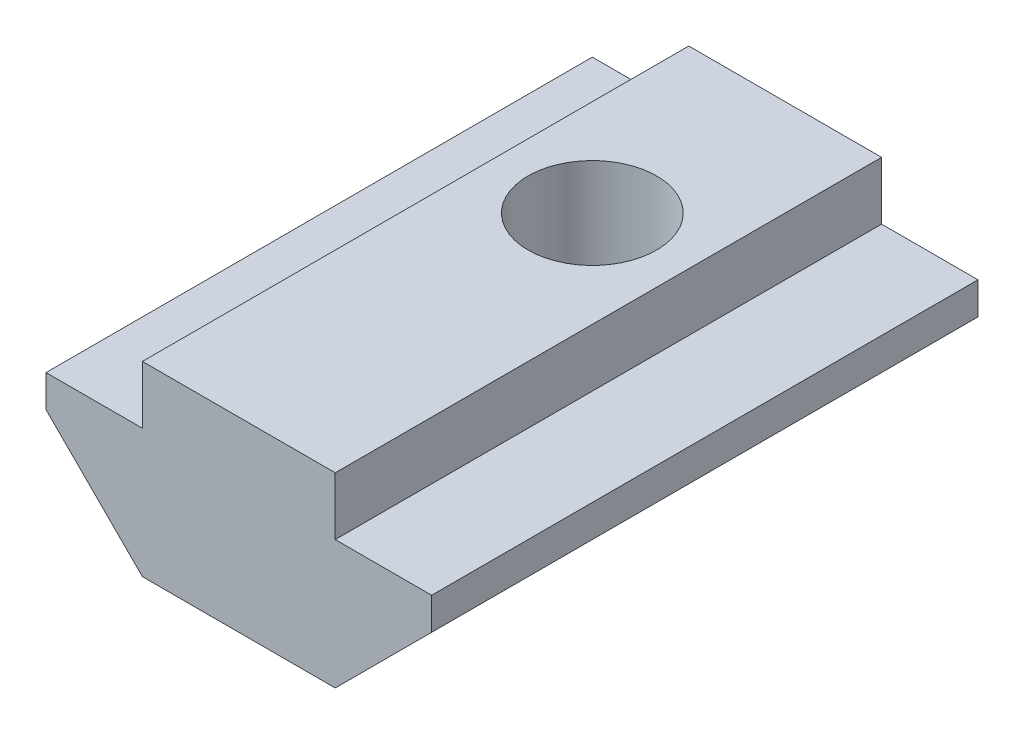
ISO-10303-21;
HEADER;
FILE_DESCRIPTION(('STEP AP214'),'2;1');
FILE_NAME('part.step','',(''),(''),'','','');
FILE_SCHEMA(('AUTOMOTIVE_DESIGN { 1 0 10303 214 1 1 1 1 }'));
ENDSEC;
DATA;
#1=APPLICATION_CONTEXT('core data for automotive mechanical design processes');
#2=APPLICATION_PROTOCOL_DEFINITION('international standard','automotive_design',2000,#1);
#3=PRODUCT_CONTEXT('',#1,'mechanical');
#4=PRODUCT('Part','Part','',(#3));
#5=PRODUCT_RELATED_PRODUCT_CATEGORY('part','',(#4));
#6=PRODUCT_DEFINITION_FORMATION('','',#4);
#7=PRODUCT_DEFINITION_CONTEXT('part definition',#1,'design');
#8=PRODUCT_DEFINITION('design','',#6,#7);
#9=PRODUCT_DEFINITION_SHAPE('','',#8);
#10=(LENGTH_UNIT() NAMED_UNIT(*) SI_UNIT(.MILLI.,.METRE.));
#11=(NAMED_UNIT(*) PLANE_ANGLE_UNIT() SI_UNIT($,.RADIAN.));
#12=(NAMED_UNIT(*) SI_UNIT($,.STERADIAN.) SOLID_ANGLE_UNIT());
#13=UNCERTAINTY_MEASURE_WITH_UNIT(LENGTH_MEASURE(1.E-05),#10,'distance_accuracy_value','');
#14=(GEOMETRIC_REPRESENTATION_CONTEXT(3) GLOBAL_UNCERTAINTY_ASSIGNED_CONTEXT((#13)) GLOBAL_UNIT_ASSIGNED_CONTEXT((#10,
#11,#12)) REPRESENTATION_CONTEXT('',''));
#15=CARTESIAN_POINT('',(0.,0.,0.));
#16=DIRECTION('',(0.,0.,1.));
#17=DIRECTION('',(1.,0.,0.));
#18=AXIS2_PLACEMENT_3D('',#15,#16,#17);
#19=CARTESIAN_POINT('',(-3.00000000000001,0.,17.));
#20=DIRECTION('',(0.707106781186549,0.707106781186547,0.));
#21=DIRECTION('',(-0.707106781186546,0.707106781186549,0.));
#22=AXIS2_PLACEMENT_3D('',#19,#20,#21);
#23=PLANE('',#22);
#24=DIRECTION('',(0.707106781186546,-0.707106781186549,0.));
#25=VECTOR('',#24,1.);
#26=CARTESIAN_POINT('',(-3.00000000000001,0.,0.));
#27=LINE('',#26,#25);
#28=CARTESIAN_POINT('',(-6.,3.,0.));
#29=VERTEX_POINT('',#28);
#30=CARTESIAN_POINT('',(-3.00000000000001,0.,0.));
#31=VERTEX_POINT('',#30);
#32=EDGE_CURVE('E145',#29,#31,#27,.T.);
#33=ORIENTED_EDGE('',*,*,#32,.T.);
#34=DIRECTION('',(0.,0.,-1.));
#35=VECTOR('',#34,1.);
#36=CARTESIAN_POINT('',(-3.00000000000001,0.,17.));
#37=LINE('',#36,#35);
#38=CARTESIAN_POINT('',(-3.00000000000001,0.,17.));
#39=VERTEX_POINT('',#38);
#40=EDGE_CURVE('E11',#39,#31,#37,.T.);
#41=ORIENTED_EDGE('',*,*,#40,.F.);
#42=DIRECTION('',(0.707106781186546,-0.707106781186549,0.));
#43=VECTOR('',#42,1.);
#44=CARTESIAN_POINT('',(-3.00000000000001,0.,17.));
#45=LINE('',#44,#43);
#46=CARTESIAN_POINT('',(-6.,3.,17.));
#47=VERTEX_POINT('',#46);
#48=EDGE_CURVE('E164',#47,#39,#45,.T.);
#49=ORIENTED_EDGE('',*,*,#48,.F.);
#50=DIRECTION('',(0.,0.,-1.));
#51=VECTOR('',#50,1.);
#52=CARTESIAN_POINT('',(-6.,3.,17.));
#53=LINE('',#52,#51);
#54=EDGE_CURVE('E141',#47,#29,#53,.T.);
#55=ORIENTED_EDGE('',*,*,#54,.T.);
#56=EDGE_LOOP('',(#33,#41,#49,#55));
#57=FACE_BOUND('',#56,.T.);
#58=ADVANCED_FACE('F37',(#57),#23,.F.);
#59=CARTESIAN_POINT('',(3.00000000000001,0.,17.));
#60=DIRECTION('',(0.,1.,0.));
#61=DIRECTION('',(0.,0.,1.));
#62=AXIS2_PLACEMENT_3D('',#59,#60,#61);
#63=PLANE('',#62);
#64=CARTESIAN_POINT('',(0.,0.,12.));
#65=DIRECTION('',(0.,1.,0.));
#66=DIRECTION('',(0.,0.,1.));
#67=AXIS2_PLACEMENT_3D('',#64,#65,#66);
#68=CIRCLE('',#67,1.5);
#69=CARTESIAN_POINT('',(0.,0.,13.5));
#70=VERTEX_POINT('',#69);
#71=EDGE_CURVE('E214',#70,#70,#68,.T.);
#72=ORIENTED_EDGE('',*,*,#71,.T.);
#73=EDGE_LOOP('',(#72));
#74=FACE_BOUND('',#73,.T.);
#75=CARTESIAN_POINT('',(0.,0.,6.));
#76=DIRECTION('',(0.,1.,0.));
#77=DIRECTION('',(0.,0.,1.));
#78=AXIS2_PLACEMENT_3D('',#75,#76,#77);
#79=CIRCLE('',#78,2.);
#80=CARTESIAN_POINT('',(0.,0.,8.));
#81=VERTEX_POINT('',#80);
#82=EDGE_CURVE('E149',#81,#81,#79,.T.);
#83=ORIENTED_EDGE('',*,*,#82,.T.);
#84=EDGE_LOOP('',(#83));
#85=FACE_BOUND('',#84,.T.);
#86=DIRECTION('',(1.,0.,0.));
#87=VECTOR('',#86,1.);
#88=CARTESIAN_POINT('',(3.00000000000001,0.,0.));
#89=LINE('',#88,#87);
#90=CARTESIAN_POINT('',(3.00000000000001,0.,0.));
#91=VERTEX_POINT('',#90);
#92=EDGE_CURVE('E148',#31,#91,#89,.T.);
#93=ORIENTED_EDGE('',*,*,#92,.T.);
#94=DIRECTION('',(0.,0.,-1.));
#95=VECTOR('',#94,1.);
#96=CARTESIAN_POINT('',(3.00000000000001,0.,17.));
#97=LINE('',#96,#95);
#98=CARTESIAN_POINT('',(3.00000000000001,0.,17.));
#99=VERTEX_POINT('',#98);
#100=EDGE_CURVE('E45',#99,#91,#97,.T.);
#101=ORIENTED_EDGE('',*,*,#100,.F.);
#102=DIRECTION('',(1.,0.,0.));
#103=VECTOR('',#102,1.);
#104=CARTESIAN_POINT('',(3.00000000000001,0.,17.));
#105=LINE('',#104,#103);
#106=EDGE_CURVE('E102',#39,#99,#105,.T.);
#107=ORIENTED_EDGE('',*,*,#106,.F.);
#108=ORIENTED_EDGE('',*,*,#40,.T.);
#109=EDGE_LOOP('',(#93,#101,#107,#108));
#110=FACE_BOUND('',#109,.T.);
#111=ADVANCED_FACE('F220',(#74,#85,#110),#63,.F.);
#112=CARTESIAN_POINT('',(3.00000000000001,0.,17.));
#113=DIRECTION('',(-0.707106781186548,0.707106781186547,0.));
#114=DIRECTION('',(-0.707106781186547,-0.707106781186548,0.));
#115=AXIS2_PLACEMENT_3D('',#112,#113,#114);
#116=PLANE('',#115);
#117=DIRECTION('',(0.707106781186547,0.707106781186548,0.));
#118=VECTOR('',#117,1.);
#119=CARTESIAN_POINT('',(3.00000000000001,0.,0.));
#120=LINE('',#119,#118);
#121=CARTESIAN_POINT('',(6.,2.99999999999999,0.));
#122=VERTEX_POINT('',#121);
#123=EDGE_CURVE('E151',#91,#122,#120,.T.);
#124=ORIENTED_EDGE('',*,*,#123,.T.);
#125=DIRECTION('',(0.,0.,-1.));
#126=VECTOR('',#125,1.);
#127=CARTESIAN_POINT('',(6.,2.99999999999999,17.));
#128=LINE('',#127,#126);
#129=CARTESIAN_POINT('',(6.,2.99999999999999,17.));
#130=VERTEX_POINT('',#129);
#131=EDGE_CURVE('E177',#130,#122,#128,.T.);
#132=ORIENTED_EDGE('',*,*,#131,.F.);
#133=DIRECTION('',(0.707106781186547,0.707106781186548,0.));
#134=VECTOR('',#133,1.);
#135=CARTESIAN_POINT('',(3.00000000000001,0.,17.));
#136=LINE('',#135,#134);
#137=EDGE_CURVE('E185',#99,#130,#136,.T.);
#138=ORIENTED_EDGE('',*,*,#137,.F.);
#139=ORIENTED_EDGE('',*,*,#100,.T.);
#140=EDGE_LOOP('',(#124,#132,#138,#139));
#141=FACE_BOUND('',#140,.T.);
#142=ADVANCED_FACE('F183',(#141),#116,.F.);
#143=CARTESIAN_POINT('',(6.,2.99999999999999,17.));
#144=DIRECTION('',(-1.,0.,0.));
#145=DIRECTION('',(0.,0.,1.));
#146=AXIS2_PLACEMENT_3D('',#143,#144,#145);
#147=PLANE('',#146);
#148=DIRECTION('',(0.,1.,0.));
#149=VECTOR('',#148,1.);
#150=CARTESIAN_POINT('',(6.,2.99999999999999,0.));
#151=LINE('',#150,#149);
#152=CARTESIAN_POINT('',(6.,4.,0.));
#153=VERTEX_POINT('',#152);
#154=EDGE_CURVE('E153',#122,#153,#151,.T.);
#155=ORIENTED_EDGE('',*,*,#154,.T.);
#156=DIRECTION('',(0.,0.,-1.));
#157=VECTOR('',#156,1.);
#158=CARTESIAN_POINT('',(6.,4.,17.));
#159=LINE('',#158,#157);
#160=CARTESIAN_POINT('',(6.,4.,17.));
#161=VERTEX_POINT('',#160);
#162=EDGE_CURVE('E174',#161,#153,#159,.T.);
#163=ORIENTED_EDGE('',*,*,#162,.F.);
#164=DIRECTION('',(0.,1.,0.));
#165=VECTOR('',#164,1.);
#166=CARTESIAN_POINT('',(6.,2.99999999999999,17.));
#167=LINE('',#166,#165);
#168=EDGE_CURVE('E203',#130,#161,#167,.T.);
#169=ORIENTED_EDGE('',*,*,#168,.F.);
#170=ORIENTED_EDGE('',*,*,#131,.T.);
#171=EDGE_LOOP('',(#155,#163,#169,#170));
#172=FACE_BOUND('',#171,.T.);
#173=ADVANCED_FACE('F194',(#172),#147,.F.);
#174=CARTESIAN_POINT('',(6.,4.,17.));
#175=DIRECTION('',(0.,-1.,0.));
#176=DIRECTION('',(0.,0.,-1.));
#177=AXIS2_PLACEMENT_3D('',#174,#175,#176);
#178=PLANE('',#177);
#179=DIRECTION('',(-1.,0.,0.));
#180=VECTOR('',#179,1.);
#181=CARTESIAN_POINT('',(6.,4.,0.));
#182=LINE('',#181,#180);
#183=CARTESIAN_POINT('',(3.,4.,0.));
#184=VERTEX_POINT('',#183);
#185=EDGE_CURVE('E155',#153,#184,#182,.T.);
#186=ORIENTED_EDGE('',*,*,#185,.T.);
#187=DIRECTION('',(0.,0.,-1.));
#188=VECTOR('',#187,1.);
#189=CARTESIAN_POINT('',(3.,4.,17.));
#190=LINE('',#189,#188);
#191=CARTESIAN_POINT('',(3.,4.,17.));
#192=VERTEX_POINT('',#191);
#193=EDGE_CURVE('E171',#192,#184,#190,.T.);
#194=ORIENTED_EDGE('',*,*,#193,.F.);
#195=DIRECTION('',(-1.,0.,0.));
#196=VECTOR('',#195,1.);
#197=CARTESIAN_POINT('',(6.,4.,17.));
#198=LINE('',#197,#196);
#199=EDGE_CURVE('E200',#161,#192,#198,.T.);
#200=ORIENTED_EDGE('',*,*,#199,.F.);
#201=ORIENTED_EDGE('',*,*,#162,.T.);
#202=EDGE_LOOP('',(#186,#194,#200,#201));
#203=FACE_BOUND('',#202,.T.);
#204=ADVANCED_FACE('F198',(#203),#178,.F.);
#205=CARTESIAN_POINT('',(3.,4.,17.));
#206=DIRECTION('',(-1.,0.,0.));
#207=DIRECTION('',(0.,0.,1.));
#208=AXIS2_PLACEMENT_3D('',#205,#206,#207);
#209=PLANE('',#208);
#210=DIRECTION('',(0.,1.,0.));
#211=VECTOR('',#210,1.);
#212=CARTESIAN_POINT('',(3.,4.,0.));
#213=LINE('',#212,#211);
#214=CARTESIAN_POINT('',(3.,5.8,0.));
#215=VERTEX_POINT('',#214);
#216=EDGE_CURVE('E157',#184,#215,#213,.T.);
#217=ORIENTED_EDGE('',*,*,#216,.T.);
#218=DIRECTION('',(0.,0.,-1.));
#219=VECTOR('',#218,1.);
#220=CARTESIAN_POINT('',(3.,5.8,17.));
#221=LINE('',#220,#219);
#222=CARTESIAN_POINT('',(3.,5.8,17.));
#223=VERTEX_POINT('',#222);
#224=EDGE_CURVE('E168',#223,#215,#221,.T.);
#225=ORIENTED_EDGE('',*,*,#224,.F.);
#226=DIRECTION('',(0.,1.,0.));
#227=VECTOR('',#226,1.);
#228=CARTESIAN_POINT('',(3.,4.,17.));
#229=LINE('',#228,#227);
#230=EDGE_CURVE('E202',#192,#223,#229,.T.);
#231=ORIENTED_EDGE('',*,*,#230,.F.);
#232=ORIENTED_EDGE('',*,*,#193,.T.);
#233=EDGE_LOOP('',(#217,#225,#231,#232));
#234=FACE_BOUND('',#233,.T.);
#235=ADVANCED_FACE('F244',(#234),#209,.F.);
#236=CARTESIAN_POINT('',(-3.,5.8,17.));
#237=DIRECTION('',(0.,-1.,0.));
#238=DIRECTION('',(0.,0.,-1.));
#239=AXIS2_PLACEMENT_3D('',#236,#237,#238);
#240=PLANE('',#239);
#241=CARTESIAN_POINT('',(0.,5.8,6.));
#242=DIRECTION('',(0.,1.,0.));
#243=DIRECTION('',(0.,0.,1.));
#244=AXIS2_PLACEMENT_3D('',#241,#242,#243);
#245=CIRCLE('',#244,2.);
#246=CARTESIAN_POINT('',(0.,5.8,8.));
#247=VERTEX_POINT('',#246);
#248=EDGE_CURVE('E211',#247,#247,#245,.T.);
#249=ORIENTED_EDGE('',*,*,#248,.F.);
#250=EDGE_LOOP('',(#249));
#251=FACE_BOUND('',#250,.T.);
#252=DIRECTION('',(-1.,0.,0.));
#253=VECTOR('',#252,1.);
#254=CARTESIAN_POINT('',(-3.,5.8,0.));
#255=LINE('',#254,#253);
#256=CARTESIAN_POINT('',(-3.,5.8,0.));
#257=VERTEX_POINT('',#256);
#258=EDGE_CURVE('E159',#215,#257,#255,.T.);
#259=ORIENTED_EDGE('',*,*,#258,.T.);
#260=DIRECTION('',(0.,0.,-1.));
#261=VECTOR('',#260,1.);
#262=CARTESIAN_POINT('',(-3.,5.8,17.));
#263=LINE('',#262,#261);
#264=CARTESIAN_POINT('',(-3.,5.8,17.));
#265=VERTEX_POINT('',#264);
#266=EDGE_CURVE('E136',#265,#257,#263,.T.);
#267=ORIENTED_EDGE('',*,*,#266,.F.);
#268=DIRECTION('',(-1.,0.,0.));
#269=VECTOR('',#268,1.);
#270=CARTESIAN_POINT('',(-3.,5.8,17.));
#271=LINE('',#270,#269);
#272=EDGE_CURVE('E127',#223,#265,#271,.T.);
#273=ORIENTED_EDGE('',*,*,#272,.F.);
#274=ORIENTED_EDGE('',*,*,#224,.T.);
#275=EDGE_LOOP('',(#259,#267,#273,#274));
#276=FACE_BOUND('',#275,.T.);
#277=ADVANCED_FACE('F241',(#251,#276),#240,.F.);
#278=CARTESIAN_POINT('',(-3.,4.,17.));
#279=DIRECTION('',(1.,0.,0.));
#280=DIRECTION('',(0.,0.,-1.));
#281=AXIS2_PLACEMENT_3D('',#278,#279,#280);
#282=PLANE('',#281);
#283=DIRECTION('',(0.,-1.,0.));
#284=VECTOR('',#283,1.);
#285=CARTESIAN_POINT('',(-3.,4.,0.));
#286=LINE('',#285,#284);
#287=CARTESIAN_POINT('',(-3.,4.,0.));
#288=VERTEX_POINT('',#287);
#289=EDGE_CURVE('E135',#257,#288,#286,.T.);
#290=ORIENTED_EDGE('',*,*,#289,.T.);
#291=DIRECTION('',(0.,0.,-1.));
#292=VECTOR('',#291,1.);
#293=CARTESIAN_POINT('',(-3.,4.,17.));
#294=LINE('',#293,#292);
#295=CARTESIAN_POINT('',(-3.,4.,17.));
#296=VERTEX_POINT('',#295);
#297=EDGE_CURVE('E132',#296,#288,#294,.T.);
#298=ORIENTED_EDGE('',*,*,#297,.F.);
#299=DIRECTION('',(0.,-1.,0.));
#300=VECTOR('',#299,1.);
#301=CARTESIAN_POINT('',(-3.,4.,17.));
#302=LINE('',#301,#300);
#303=EDGE_CURVE('E121',#265,#296,#302,.T.);
#304=ORIENTED_EDGE('',*,*,#303,.F.);
#305=ORIENTED_EDGE('',*,*,#266,.T.);
#306=EDGE_LOOP('',(#290,#298,#304,#305));
#307=FACE_BOUND('',#306,.T.);
#308=ADVANCED_FACE('F133',(#307),#282,.F.);
#309=CARTESIAN_POINT('',(-6.,4.,17.));
#310=DIRECTION('',(0.,-1.,0.));
#311=DIRECTION('',(0.,0.,-1.));
#312=AXIS2_PLACEMENT_3D('',#309,#310,#311);
#313=PLANE('',#312);
#314=DIRECTION('',(-1.,0.,0.));
#315=VECTOR('',#314,1.);
#316=CARTESIAN_POINT('',(-6.,4.,0.));
#317=LINE('',#316,#315);
#318=CARTESIAN_POINT('',(-6.,4.,0.));
#319=VERTEX_POINT('',#318);
#320=EDGE_CURVE('E88',#288,#319,#317,.T.);
#321=ORIENTED_EDGE('',*,*,#320,.T.);
#322=DIRECTION('',(0.,0.,-1.));
#323=VECTOR('',#322,1.);
#324=CARTESIAN_POINT('',(-6.,4.,17.));
#325=LINE('',#324,#323);
#326=CARTESIAN_POINT('',(-6.,4.,17.));
#327=VERTEX_POINT('',#326);
#328=EDGE_CURVE('E137',#327,#319,#325,.T.);
#329=ORIENTED_EDGE('',*,*,#328,.F.);
#330=DIRECTION('',(-1.,0.,0.));
#331=VECTOR('',#330,1.);
#332=CARTESIAN_POINT('',(-6.,4.,17.));
#333=LINE('',#332,#331);
#334=EDGE_CURVE('E125',#296,#327,#333,.T.);
#335=ORIENTED_EDGE('',*,*,#334,.F.);
#336=ORIENTED_EDGE('',*,*,#297,.T.);
#337=EDGE_LOOP('',(#321,#329,#335,#336));
#338=FACE_BOUND('',#337,.T.);
#339=ADVANCED_FACE('F139',(#338),#313,.F.);
#340=CARTESIAN_POINT('',(-6.,3.,17.));
#341=DIRECTION('',(1.,0.,0.));
#342=DIRECTION('',(0.,0.,-1.));
#343=AXIS2_PLACEMENT_3D('',#340,#341,#342);
#344=PLANE('',#343);
#345=DIRECTION('',(0.,-1.,0.));
#346=VECTOR('',#345,1.);
#347=CARTESIAN_POINT('',(-6.,3.,0.));
#348=LINE('',#347,#346);
#349=EDGE_CURVE('E94',#319,#29,#348,.T.);
#350=ORIENTED_EDGE('',*,*,#349,.T.);
#351=ORIENTED_EDGE('',*,*,#54,.F.);
#352=DIRECTION('',(0.,-1.,0.));
#353=VECTOR('',#352,1.);
#354=CARTESIAN_POINT('',(-6.,3.,17.));
#355=LINE('',#354,#353);
#356=EDGE_CURVE('E53',#327,#47,#355,.T.);
#357=ORIENTED_EDGE('',*,*,#356,.F.);
#358=ORIENTED_EDGE('',*,*,#328,.T.);
#359=EDGE_LOOP('',(#350,#351,#357,#358));
#360=FACE_BOUND('',#359,.T.);
#361=ADVANCED_FACE('F292',(#360),#344,.F.);
#362=CARTESIAN_POINT('',(0.,0.,17.));
#363=DIRECTION('',(0.,0.,-1.));
#364=DIRECTION('',(-1.,0.,0.));
#365=AXIS2_PLACEMENT_3D('',#362,#363,#364);
#366=PLANE('',#365);
#367=ORIENTED_EDGE('',*,*,#48,.T.);
#368=ORIENTED_EDGE('',*,*,#106,.T.);
#369=ORIENTED_EDGE('',*,*,#137,.T.);
#370=ORIENTED_EDGE('',*,*,#168,.T.);
#371=ORIENTED_EDGE('',*,*,#199,.T.);
#372=ORIENTED_EDGE('',*,*,#230,.T.);
#373=ORIENTED_EDGE('',*,*,#272,.T.);
#374=ORIENTED_EDGE('',*,*,#303,.T.);
#375=ORIENTED_EDGE('',*,*,#334,.T.);
#376=ORIENTED_EDGE('',*,*,#356,.T.);
#377=EDGE_LOOP('',(#367,#368,#369,#370,#371,#372,#373,#374,#375,#376));
#378=FACE_BOUND('',#377,.T.);
#379=ADVANCED_FACE('F123',(#378),#366,.F.);
#380=CARTESIAN_POINT('',(0.,0.,0.));
#381=DIRECTION('',(0.,0.,-1.));
#382=DIRECTION('',(-1.,0.,0.));
#383=AXIS2_PLACEMENT_3D('',#380,#381,#382);
#384=PLANE('',#383);
#385=ORIENTED_EDGE('',*,*,#32,.F.);
#386=ORIENTED_EDGE('',*,*,#349,.F.);
#387=ORIENTED_EDGE('',*,*,#320,.F.);
#388=ORIENTED_EDGE('',*,*,#289,.F.);
#389=ORIENTED_EDGE('',*,*,#258,.F.);
#390=ORIENTED_EDGE('',*,*,#216,.F.);
#391=ORIENTED_EDGE('',*,*,#185,.F.);
#392=ORIENTED_EDGE('',*,*,#154,.F.);
#393=ORIENTED_EDGE('',*,*,#123,.F.);
#394=ORIENTED_EDGE('',*,*,#92,.F.);
#395=EDGE_LOOP('',(#385,#386,#387,#388,#389,#390,#391,#392,#393,#394));
#396=FACE_BOUND('',#395,.T.);
#397=ADVANCED_FACE('F189',(#396),#384,.T.);
#398=CARTESIAN_POINT('',(0.,0.,6.));
#399=DIRECTION('',(0.,1.,0.));
#400=DIRECTION('',(0.,0.,1.));
#401=AXIS2_PLACEMENT_3D('',#398,#399,#400);
#402=CYLINDRICAL_SURFACE('',#401,2.);
#403=ORIENTED_EDGE('',*,*,#82,.F.);
#404=EDGE_LOOP('',(#403));
#405=FACE_BOUND('',#404,.T.);
#406=ORIENTED_EDGE('',*,*,#248,.T.);
#407=EDGE_LOOP('',(#406));
#408=FACE_BOUND('',#407,.T.);
#409=ADVANCED_FACE('F225',(#405,#408),#402,.F.);
#410=CARTESIAN_POINT('',(0.,0.,12.));
#411=DIRECTION('',(0.,1.,0.));
#412=DIRECTION('',(0.,0.,1.));
#413=AXIS2_PLACEMENT_3D('',#410,#411,#412);
#414=SPHERICAL_SURFACE('',#413,1.5);
#415=ORIENTED_EDGE('',*,*,#71,.F.);
#416=EDGE_LOOP('',(#415));
#417=FACE_BOUND('',#416,.T.);
#418=ADVANCED_FACE('F223',(#417),#414,.T.);
#419=CLOSED_SHELL('',(#58,#111,#142,#173,#204,#235,#277,#308,#339,#361,#379,#397,#409,#418));
#420=MANIFOLD_SOLID_BREP('B2',#419);
#421=ADVANCED_BREP_SHAPE_REPRESENTATION('',(#18,#420),#14);
#422=SHAPE_DEFINITION_REPRESENTATION(#9,#421);
ENDSEC;
END-ISO-10303-21;
